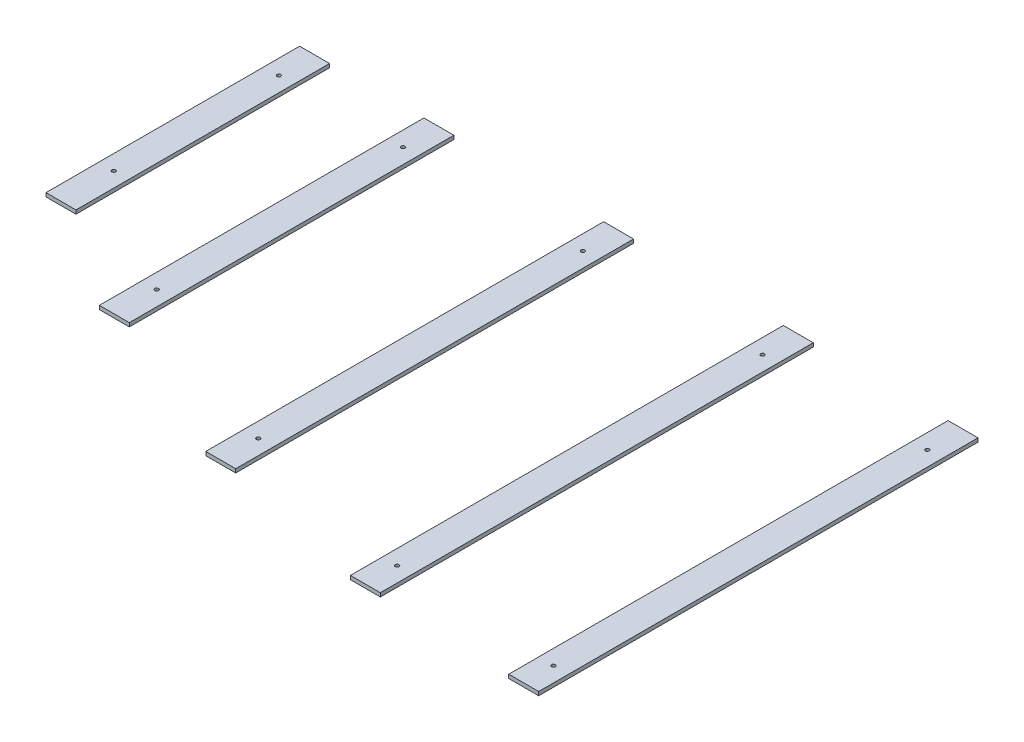
ISO-10303-21;
HEADER;
FILE_DESCRIPTION(('STEP AP214'),'2;1');
FILE_NAME('part.step','',(''),(''),'','','');
FILE_SCHEMA(('AUTOMOTIVE_DESIGN { 1 0 10303 214 1 1 1 1 }'));
ENDSEC;
DATA;
#1=APPLICATION_CONTEXT('core data for automotive mechanical design processes');
#2=APPLICATION_PROTOCOL_DEFINITION('international standard','automotive_design',2000,#1);
#3=PRODUCT_CONTEXT('',#1,'mechanical');
#4=PRODUCT('Part','Part','',(#3));
#5=PRODUCT_RELATED_PRODUCT_CATEGORY('part','',(#4));
#6=PRODUCT_DEFINITION_FORMATION('','',#4);
#7=PRODUCT_DEFINITION_CONTEXT('part definition',#1,'design');
#8=PRODUCT_DEFINITION('design','',#6,#7);
#9=PRODUCT_DEFINITION_SHAPE('','',#8);
#10=(LENGTH_UNIT() NAMED_UNIT(*) SI_UNIT(.MILLI.,.METRE.));
#11=(NAMED_UNIT(*) PLANE_ANGLE_UNIT() SI_UNIT($,.RADIAN.));
#12=(NAMED_UNIT(*) SI_UNIT($,.STERADIAN.) SOLID_ANGLE_UNIT());
#13=UNCERTAINTY_MEASURE_WITH_UNIT(LENGTH_MEASURE(1.E-05),#10,'distance_accuracy_value','');
#14=(GEOMETRIC_REPRESENTATION_CONTEXT(3) GLOBAL_UNCERTAINTY_ASSIGNED_CONTEXT((#13)) GLOBAL_UNIT_ASSIGNED_CONTEXT((#10,
#11,#12)) REPRESENTATION_CONTEXT('',''));
#15=CARTESIAN_POINT('',(0.,0.,0.));
#16=DIRECTION('',(0.,0.,1.));
#17=DIRECTION('',(1.,0.,0.));
#18=AXIS2_PLACEMENT_3D('',#15,#16,#17);
#19=CARTESIAN_POINT('',(0.,25.,0.));
#20=DIRECTION('',(0.,-1.,0.));
#21=DIRECTION('',(0.,0.,-1.));
#22=AXIS2_PLACEMENT_3D('',#19,#20,#21);
#23=PLANE('',#22);
#24=DIRECTION('',(0.,0.,-1.));
#25=VECTOR('',#24,1.);
#26=CARTESIAN_POINT('',(18902.9446458133,25.,9942.5828739722));
#27=LINE('',#26,#25);
#28=CARTESIAN_POINT('',(18902.9446458133,25.,11636.2194573529));
#29=VERTEX_POINT('',#28);
#30=CARTESIAN_POINT('',(18902.9446458133,25.,9942.5828739722));
#31=VERTEX_POINT('',#30);
#32=EDGE_CURVE('E101',#29,#31,#27,.T.);
#33=ORIENTED_EDGE('',*,*,#32,.T.);
#34=DIRECTION('',(-1.,0.,0.));
#35=VECTOR('',#34,1.);
#36=CARTESIAN_POINT('',(18902.9446458133,25.,9942.5828739722));
#37=LINE('',#36,#35);
#38=CARTESIAN_POINT('',(18702.9446458133,25.,9942.5828739722));
#39=VERTEX_POINT('',#38);
#40=EDGE_CURVE('E96',#31,#39,#37,.T.);
#41=ORIENTED_EDGE('',*,*,#40,.T.);
#42=DIRECTION('',(0.,0.,1.));
#43=VECTOR('',#42,1.);
#44=CARTESIAN_POINT('',(18702.9446458133,25.,9942.5828739722));
#45=LINE('',#44,#43);
#46=CARTESIAN_POINT('',(18702.9446458133,25.,11636.2194573529));
#47=VERTEX_POINT('',#46);
#48=EDGE_CURVE('E99',#39,#47,#45,.T.);
#49=ORIENTED_EDGE('',*,*,#48,.T.);
#50=DIRECTION('',(1.,0.,0.));
#51=VECTOR('',#50,1.);
#52=CARTESIAN_POINT('',(18902.9446458133,25.,11636.2194573529));
#53=LINE('',#52,#51);
#54=EDGE_CURVE('E66',#47,#29,#53,.T.);
#55=ORIENTED_EDGE('',*,*,#54,.T.);
#56=EDGE_LOOP('',(#33,#41,#49,#55));
#57=FACE_BOUND('',#56,.T.);
#58=CARTESIAN_POINT('',(18802.9446458133,25.,11283.6697787735));
#59=DIRECTION('',(0.,1.,0.));
#60=DIRECTION('',(0.,0.,1.));
#61=AXIS2_PLACEMENT_3D('',#58,#59,#60);
#62=CIRCLE('',#61,12.4999999999988);
#63=CARTESIAN_POINT('',(18802.9446458133,25.,11296.1697787735));
#64=VERTEX_POINT('',#63);
#65=EDGE_CURVE('E116',#64,#64,#62,.T.);
#66=ORIENTED_EDGE('',*,*,#65,.F.);
#67=EDGE_LOOP('',(#66));
#68=FACE_BOUND('',#67,.T.);
#69=CARTESIAN_POINT('',(18802.9446458133,25.,10181.0304593336));
#70=DIRECTION('',(0.,1.,0.));
#71=DIRECTION('',(0.,0.,1.));
#72=AXIS2_PLACEMENT_3D('',#69,#70,#71);
#73=CIRCLE('',#72,12.4999999999988);
#74=CARTESIAN_POINT('',(18802.9446458133,25.,10193.5304593336));
#75=VERTEX_POINT('',#74);
#76=EDGE_CURVE('E131',#75,#75,#73,.T.);
#77=ORIENTED_EDGE('',*,*,#76,.F.);
#78=EDGE_LOOP('',(#77));
#79=FACE_BOUND('',#78,.T.);
#80=ADVANCED_FACE('F49',(#57,#68,#79),#23,.F.);
#81=CARTESIAN_POINT('',(0.,0.,0.));
#82=DIRECTION('',(0.,-1.,0.));
#83=DIRECTION('',(0.,0.,-1.));
#84=AXIS2_PLACEMENT_3D('',#81,#82,#83);
#85=PLANE('',#84);
#86=CARTESIAN_POINT('',(18802.9446458133,0.,11283.6697787735));
#87=DIRECTION('',(0.,1.,0.));
#88=DIRECTION('',(0.,0.,1.));
#89=AXIS2_PLACEMENT_3D('',#86,#87,#88);
#90=CIRCLE('',#89,12.4999999999988);
#91=CARTESIAN_POINT('',(18802.9446458133,0.,11296.1697787735));
#92=VERTEX_POINT('',#91);
#93=EDGE_CURVE('E128',#92,#92,#90,.T.);
#94=ORIENTED_EDGE('',*,*,#93,.T.);
#95=EDGE_LOOP('',(#94));
#96=FACE_BOUND('',#95,.T.);
#97=DIRECTION('',(0.,0.,-1.));
#98=VECTOR('',#97,1.);
#99=CARTESIAN_POINT('',(18902.9446458133,0.,9942.5828739722));
#100=LINE('',#99,#98);
#101=CARTESIAN_POINT('',(18902.9446458133,0.,11636.2194573529));
#102=VERTEX_POINT('',#101);
#103=CARTESIAN_POINT('',(18902.9446458133,0.,9942.5828739722));
#104=VERTEX_POINT('',#103);
#105=EDGE_CURVE('E113',#102,#104,#100,.T.);
#106=ORIENTED_EDGE('',*,*,#105,.F.);
#107=DIRECTION('',(1.,0.,0.));
#108=VECTOR('',#107,1.);
#109=CARTESIAN_POINT('',(18902.9446458133,0.,11636.2194573529));
#110=LINE('',#109,#108);
#111=CARTESIAN_POINT('',(18702.9446458133,0.,11636.2194573529));
#112=VERTEX_POINT('',#111);
#113=EDGE_CURVE('E89',#112,#102,#110,.T.);
#114=ORIENTED_EDGE('',*,*,#113,.F.);
#115=DIRECTION('',(0.,0.,1.));
#116=VECTOR('',#115,1.);
#117=CARTESIAN_POINT('',(18702.9446458133,0.,9942.5828739722));
#118=LINE('',#117,#116);
#119=CARTESIAN_POINT('',(18702.9446458133,0.,9942.5828739722));
#120=VERTEX_POINT('',#119);
#121=EDGE_CURVE('E83',#120,#112,#118,.T.);
#122=ORIENTED_EDGE('',*,*,#121,.F.);
#123=DIRECTION('',(-1.,0.,0.));
#124=VECTOR('',#123,1.);
#125=CARTESIAN_POINT('',(18902.9446458133,0.,9942.5828739722));
#126=LINE('',#125,#124);
#127=EDGE_CURVE('E105',#104,#120,#126,.T.);
#128=ORIENTED_EDGE('',*,*,#127,.F.);
#129=EDGE_LOOP('',(#106,#114,#122,#128));
#130=FACE_BOUND('',#129,.T.);
#131=CARTESIAN_POINT('',(18802.9446458133,0.,10181.0304593336));
#132=DIRECTION('',(0.,1.,0.));
#133=DIRECTION('',(0.,0.,1.));
#134=AXIS2_PLACEMENT_3D('',#131,#132,#133);
#135=CIRCLE('',#134,12.4999999999988);
#136=CARTESIAN_POINT('',(18802.9446458133,0.,10193.5304593336));
#137=VERTEX_POINT('',#136);
#138=EDGE_CURVE('E134',#137,#137,#135,.T.);
#139=ORIENTED_EDGE('',*,*,#138,.T.);
#140=EDGE_LOOP('',(#139));
#141=FACE_BOUND('',#140,.T.);
#142=ADVANCED_FACE('F124',(#96,#130,#141),#85,.T.);
#143=CARTESIAN_POINT('',(18902.9446458133,25.,9942.5828739722));
#144=DIRECTION('',(-1.,0.,0.));
#145=DIRECTION('',(0.,0.,1.));
#146=AXIS2_PLACEMENT_3D('',#143,#144,#145);
#147=PLANE('',#146);
#148=ORIENTED_EDGE('',*,*,#105,.T.);
#149=DIRECTION('',(0.,-1.,0.));
#150=VECTOR('',#149,1.);
#151=CARTESIAN_POINT('',(18902.9446458133,25.,9942.5828739722));
#152=LINE('',#151,#150);
#153=EDGE_CURVE('E12',#31,#104,#152,.T.);
#154=ORIENTED_EDGE('',*,*,#153,.F.);
#155=ORIENTED_EDGE('',*,*,#32,.F.);
#156=DIRECTION('',(0.,-1.,0.));
#157=VECTOR('',#156,1.);
#158=CARTESIAN_POINT('',(18902.9446458133,25.,11636.2194573529));
#159=LINE('',#158,#157);
#160=EDGE_CURVE('E109',#29,#102,#159,.T.);
#161=ORIENTED_EDGE('',*,*,#160,.T.);
#162=EDGE_LOOP('',(#148,#154,#155,#161));
#163=FACE_BOUND('',#162,.T.);
#164=ADVANCED_FACE('F51',(#163),#147,.F.);
#165=CARTESIAN_POINT('',(18902.9446458133,25.,9942.5828739722));
#166=DIRECTION('',(0.,0.,1.));
#167=DIRECTION('',(1.,0.,0.));
#168=AXIS2_PLACEMENT_3D('',#165,#166,#167);
#169=PLANE('',#168);
#170=ORIENTED_EDGE('',*,*,#127,.T.);
#171=DIRECTION('',(0.,-1.,0.));
#172=VECTOR('',#171,1.);
#173=CARTESIAN_POINT('',(18702.9446458133,25.,9942.5828739722));
#174=LINE('',#173,#172);
#175=EDGE_CURVE('E58',#39,#120,#174,.T.);
#176=ORIENTED_EDGE('',*,*,#175,.F.);
#177=ORIENTED_EDGE('',*,*,#40,.F.);
#178=ORIENTED_EDGE('',*,*,#153,.T.);
#179=EDGE_LOOP('',(#170,#176,#177,#178));
#180=FACE_BOUND('',#179,.T.);
#181=ADVANCED_FACE('F104',(#180),#169,.F.);
#182=CARTESIAN_POINT('',(18702.9446458133,25.,9942.5828739722));
#183=DIRECTION('',(1.,0.,0.));
#184=DIRECTION('',(0.,0.,-1.));
#185=AXIS2_PLACEMENT_3D('',#182,#183,#184);
#186=PLANE('',#185);
#187=ORIENTED_EDGE('',*,*,#121,.T.);
#188=DIRECTION('',(0.,-1.,0.));
#189=VECTOR('',#188,1.);
#190=CARTESIAN_POINT('',(18702.9446458133,25.,11636.2194573529));
#191=LINE('',#190,#189);
#192=EDGE_CURVE('E106',#47,#112,#191,.T.);
#193=ORIENTED_EDGE('',*,*,#192,.F.);
#194=ORIENTED_EDGE('',*,*,#48,.F.);
#195=ORIENTED_EDGE('',*,*,#175,.T.);
#196=EDGE_LOOP('',(#187,#193,#194,#195));
#197=FACE_BOUND('',#196,.T.);
#198=ADVANCED_FACE('F107',(#197),#186,.F.);
#199=CARTESIAN_POINT('',(18902.9446458133,25.,11636.2194573529));
#200=DIRECTION('',(0.,0.,-1.));
#201=DIRECTION('',(-1.,0.,0.));
#202=AXIS2_PLACEMENT_3D('',#199,#200,#201);
#203=PLANE('',#202);
#204=ORIENTED_EDGE('',*,*,#113,.T.);
#205=ORIENTED_EDGE('',*,*,#160,.F.);
#206=ORIENTED_EDGE('',*,*,#54,.F.);
#207=ORIENTED_EDGE('',*,*,#192,.T.);
#208=EDGE_LOOP('',(#204,#205,#206,#207));
#209=FACE_BOUND('',#208,.T.);
#210=ADVANCED_FACE('F121',(#209),#203,.F.);
#211=CARTESIAN_POINT('',(18802.9446458133,25.,11283.6697787735));
#212=DIRECTION('',(0.,-1.,0.));
#213=DIRECTION('',(0.,0.,-1.));
#214=AXIS2_PLACEMENT_3D('',#211,#212,#213);
#215=CYLINDRICAL_SURFACE('',#214,12.4999999999988);
#216=ORIENTED_EDGE('',*,*,#65,.T.);
#217=EDGE_LOOP('',(#216));
#218=FACE_BOUND('',#217,.T.);
#219=ORIENTED_EDGE('',*,*,#93,.F.);
#220=EDGE_LOOP('',(#219));
#221=FACE_BOUND('',#220,.T.);
#222=ADVANCED_FACE('F151',(#218,#221),#215,.F.);
#223=CARTESIAN_POINT('',(18802.9446458133,25.,10181.0304593336));
#224=DIRECTION('',(0.,-1.,0.));
#225=DIRECTION('',(0.,0.,-1.));
#226=AXIS2_PLACEMENT_3D('',#223,#224,#225);
#227=CYLINDRICAL_SURFACE('',#226,12.4999999999988);
#228=ORIENTED_EDGE('',*,*,#76,.T.);
#229=EDGE_LOOP('',(#228));
#230=FACE_BOUND('',#229,.T.);
#231=ORIENTED_EDGE('',*,*,#138,.F.);
#232=EDGE_LOOP('',(#231));
#233=FACE_BOUND('',#232,.T.);
#234=ADVANCED_FACE('F140',(#230,#233),#227,.F.);
#235=CLOSED_SHELL('',(#80,#142,#164,#181,#198,#210,#222,#234));
#236=MANIFOLD_SOLID_BREP('B2',#235);
#237=CARTESIAN_POINT('',(0.,25.,0.));
#238=DIRECTION('',(0.,-1.,0.));
#239=DIRECTION('',(0.,0.,-1.));
#240=AXIS2_PLACEMENT_3D('',#237,#238,#239);
#241=PLANE('',#240);
#242=DIRECTION('',(0.,0.,-1.));
#243=VECTOR('',#242,1.);
#244=CARTESIAN_POINT('',(19732.9446458133,25.,9942.5828739722));
#245=LINE('',#244,#243);
#246=CARTESIAN_POINT('',(19732.9446458133,25.,12109.8435727021));
#247=VERTEX_POINT('',#246);
#248=CARTESIAN_POINT('',(19732.9446458133,25.,9942.5828739722));
#249=VERTEX_POINT('',#248);
#250=EDGE_CURVE('E276',#247,#249,#245,.T.);
#251=ORIENTED_EDGE('',*,*,#250,.T.);
#252=DIRECTION('',(-1.,0.,0.));
#253=VECTOR('',#252,1.);
#254=CARTESIAN_POINT('',(19732.9446458133,25.,9942.5828739722));
#255=LINE('',#254,#253);
#256=CARTESIAN_POINT('',(19532.9446458133,25.,9942.5828739722));
#257=VERTEX_POINT('',#256);
#258=EDGE_CURVE('E271',#249,#257,#255,.T.);
#259=ORIENTED_EDGE('',*,*,#258,.T.);
#260=DIRECTION('',(0.,0.,1.));
#261=VECTOR('',#260,1.);
#262=CARTESIAN_POINT('',(19532.9446458133,25.,9942.5828739722));
#263=LINE('',#262,#261);
#264=CARTESIAN_POINT('',(19532.9446458133,25.,12109.8435727021));
#265=VERTEX_POINT('',#264);
#266=EDGE_CURVE('E274',#257,#265,#263,.T.);
#267=ORIENTED_EDGE('',*,*,#266,.T.);
#268=DIRECTION('',(1.,0.,0.));
#269=VECTOR('',#268,1.);
#270=CARTESIAN_POINT('',(19732.9446458133,25.,12109.8435727021));
#271=LINE('',#270,#269);
#272=EDGE_CURVE('E241',#265,#247,#271,.T.);
#273=ORIENTED_EDGE('',*,*,#272,.T.);
#274=EDGE_LOOP('',(#251,#259,#267,#273));
#275=FACE_BOUND('',#274,.T.);
#276=CARTESIAN_POINT('',(19632.9446458133,25.,11826.9154481533));
#277=DIRECTION('',(0.,1.,0.));
#278=DIRECTION('',(0.,0.,1.));
#279=AXIS2_PLACEMENT_3D('',#276,#277,#278);
#280=CIRCLE('',#279,12.4999999999988);
#281=CARTESIAN_POINT('',(19632.9446458133,25.,11839.4154481533));
#282=VERTEX_POINT('',#281);
#283=EDGE_CURVE('E291',#282,#282,#280,.T.);
#284=ORIENTED_EDGE('',*,*,#283,.F.);
#285=EDGE_LOOP('',(#284));
#286=FACE_BOUND('',#285,.T.);
#287=CARTESIAN_POINT('',(19632.9446458133,25.,10181.0304593336));
#288=DIRECTION('',(0.,1.,0.));
#289=DIRECTION('',(0.,0.,1.));
#290=AXIS2_PLACEMENT_3D('',#287,#288,#289);
#291=CIRCLE('',#290,12.4999999999988);
#292=CARTESIAN_POINT('',(19632.9446458133,25.,10193.5304593336));
#293=VERTEX_POINT('',#292);
#294=EDGE_CURVE('E306',#293,#293,#291,.T.);
#295=ORIENTED_EDGE('',*,*,#294,.F.);
#296=EDGE_LOOP('',(#295));
#297=FACE_BOUND('',#296,.T.);
#298=ADVANCED_FACE('F224',(#275,#286,#297),#241,.F.);
#299=CARTESIAN_POINT('',(0.,0.,0.));
#300=DIRECTION('',(0.,-1.,0.));
#301=DIRECTION('',(0.,0.,-1.));
#302=AXIS2_PLACEMENT_3D('',#299,#300,#301);
#303=PLANE('',#302);
#304=CARTESIAN_POINT('',(19632.9446458133,0.,11826.9154481533));
#305=DIRECTION('',(0.,1.,0.));
#306=DIRECTION('',(0.,0.,1.));
#307=AXIS2_PLACEMENT_3D('',#304,#305,#306);
#308=CIRCLE('',#307,12.4999999999988);
#309=CARTESIAN_POINT('',(19632.9446458133,0.,11839.4154481533));
#310=VERTEX_POINT('',#309);
#311=EDGE_CURVE('E303',#310,#310,#308,.T.);
#312=ORIENTED_EDGE('',*,*,#311,.T.);
#313=EDGE_LOOP('',(#312));
#314=FACE_BOUND('',#313,.T.);
#315=DIRECTION('',(0.,0.,-1.));
#316=VECTOR('',#315,1.);
#317=CARTESIAN_POINT('',(19732.9446458133,0.,9942.5828739722));
#318=LINE('',#317,#316);
#319=CARTESIAN_POINT('',(19732.9446458133,0.,12109.8435727021));
#320=VERTEX_POINT('',#319);
#321=CARTESIAN_POINT('',(19732.9446458133,0.,9942.5828739722));
#322=VERTEX_POINT('',#321);
#323=EDGE_CURVE('E288',#320,#322,#318,.T.);
#324=ORIENTED_EDGE('',*,*,#323,.F.);
#325=DIRECTION('',(1.,0.,0.));
#326=VECTOR('',#325,1.);
#327=CARTESIAN_POINT('',(19732.9446458133,0.,12109.8435727021));
#328=LINE('',#327,#326);
#329=CARTESIAN_POINT('',(19532.9446458133,0.,12109.8435727021));
#330=VERTEX_POINT('',#329);
#331=EDGE_CURVE('E264',#330,#320,#328,.T.);
#332=ORIENTED_EDGE('',*,*,#331,.F.);
#333=DIRECTION('',(0.,0.,1.));
#334=VECTOR('',#333,1.);
#335=CARTESIAN_POINT('',(19532.9446458133,0.,9942.5828739722));
#336=LINE('',#335,#334);
#337=CARTESIAN_POINT('',(19532.9446458133,0.,9942.5828739722));
#338=VERTEX_POINT('',#337);
#339=EDGE_CURVE('E258',#338,#330,#336,.T.);
#340=ORIENTED_EDGE('',*,*,#339,.F.);
#341=DIRECTION('',(-1.,0.,0.));
#342=VECTOR('',#341,1.);
#343=CARTESIAN_POINT('',(19732.9446458133,0.,9942.5828739722));
#344=LINE('',#343,#342);
#345=EDGE_CURVE('E280',#322,#338,#344,.T.);
#346=ORIENTED_EDGE('',*,*,#345,.F.);
#347=EDGE_LOOP('',(#324,#332,#340,#346));
#348=FACE_BOUND('',#347,.T.);
#349=CARTESIAN_POINT('',(19632.9446458133,0.,10181.0304593336));
#350=DIRECTION('',(0.,1.,0.));
#351=DIRECTION('',(0.,0.,1.));
#352=AXIS2_PLACEMENT_3D('',#349,#350,#351);
#353=CIRCLE('',#352,12.4999999999988);
#354=CARTESIAN_POINT('',(19632.9446458133,0.,10193.5304593336));
#355=VERTEX_POINT('',#354);
#356=EDGE_CURVE('E309',#355,#355,#353,.T.);
#357=ORIENTED_EDGE('',*,*,#356,.T.);
#358=EDGE_LOOP('',(#357));
#359=FACE_BOUND('',#358,.T.);
#360=ADVANCED_FACE('F299',(#314,#348,#359),#303,.T.);
#361=CARTESIAN_POINT('',(19732.9446458133,25.,9942.5828739722));
#362=DIRECTION('',(-1.,0.,0.));
#363=DIRECTION('',(0.,0.,1.));
#364=AXIS2_PLACEMENT_3D('',#361,#362,#363);
#365=PLANE('',#364);
#366=ORIENTED_EDGE('',*,*,#323,.T.);
#367=DIRECTION('',(0.,-1.,0.));
#368=VECTOR('',#367,1.);
#369=CARTESIAN_POINT('',(19732.9446458133,25.,9942.5828739722));
#370=LINE('',#369,#368);
#371=EDGE_CURVE('E47',#249,#322,#370,.T.);
#372=ORIENTED_EDGE('',*,*,#371,.F.);
#373=ORIENTED_EDGE('',*,*,#250,.F.);
#374=DIRECTION('',(0.,-1.,0.));
#375=VECTOR('',#374,1.);
#376=CARTESIAN_POINT('',(19732.9446458133,25.,12109.8435727021));
#377=LINE('',#376,#375);
#378=EDGE_CURVE('E284',#247,#320,#377,.T.);
#379=ORIENTED_EDGE('',*,*,#378,.T.);
#380=EDGE_LOOP('',(#366,#372,#373,#379));
#381=FACE_BOUND('',#380,.T.);
#382=ADVANCED_FACE('F226',(#381),#365,.F.);
#383=CARTESIAN_POINT('',(19732.9446458133,25.,9942.5828739722));
#384=DIRECTION('',(0.,0.,1.));
#385=DIRECTION('',(1.,0.,0.));
#386=AXIS2_PLACEMENT_3D('',#383,#384,#385);
#387=PLANE('',#386);
#388=ORIENTED_EDGE('',*,*,#345,.T.);
#389=DIRECTION('',(0.,-1.,0.));
#390=VECTOR('',#389,1.);
#391=CARTESIAN_POINT('',(19532.9446458133,25.,9942.5828739722));
#392=LINE('',#391,#390);
#393=EDGE_CURVE('E233',#257,#338,#392,.T.);
#394=ORIENTED_EDGE('',*,*,#393,.F.);
#395=ORIENTED_EDGE('',*,*,#258,.F.);
#396=ORIENTED_EDGE('',*,*,#371,.T.);
#397=EDGE_LOOP('',(#388,#394,#395,#396));
#398=FACE_BOUND('',#397,.T.);
#399=ADVANCED_FACE('F279',(#398),#387,.F.);
#400=CARTESIAN_POINT('',(19532.9446458133,25.,9942.5828739722));
#401=DIRECTION('',(1.,0.,0.));
#402=DIRECTION('',(0.,0.,-1.));
#403=AXIS2_PLACEMENT_3D('',#400,#401,#402);
#404=PLANE('',#403);
#405=ORIENTED_EDGE('',*,*,#339,.T.);
#406=DIRECTION('',(0.,-1.,0.));
#407=VECTOR('',#406,1.);
#408=CARTESIAN_POINT('',(19532.9446458133,25.,12109.8435727021));
#409=LINE('',#408,#407);
#410=EDGE_CURVE('E281',#265,#330,#409,.T.);
#411=ORIENTED_EDGE('',*,*,#410,.F.);
#412=ORIENTED_EDGE('',*,*,#266,.F.);
#413=ORIENTED_EDGE('',*,*,#393,.T.);
#414=EDGE_LOOP('',(#405,#411,#412,#413));
#415=FACE_BOUND('',#414,.T.);
#416=ADVANCED_FACE('F282',(#415),#404,.F.);
#417=CARTESIAN_POINT('',(19732.9446458133,25.,12109.8435727021));
#418=DIRECTION('',(0.,0.,-1.));
#419=DIRECTION('',(-1.,0.,0.));
#420=AXIS2_PLACEMENT_3D('',#417,#418,#419);
#421=PLANE('',#420);
#422=ORIENTED_EDGE('',*,*,#331,.T.);
#423=ORIENTED_EDGE('',*,*,#378,.F.);
#424=ORIENTED_EDGE('',*,*,#272,.F.);
#425=ORIENTED_EDGE('',*,*,#410,.T.);
#426=EDGE_LOOP('',(#422,#423,#424,#425));
#427=FACE_BOUND('',#426,.T.);
#428=ADVANCED_FACE('F296',(#427),#421,.F.);
#429=CARTESIAN_POINT('',(19632.9446458133,25.,11826.9154481533));
#430=DIRECTION('',(0.,-1.,0.));
#431=DIRECTION('',(0.,0.,-1.));
#432=AXIS2_PLACEMENT_3D('',#429,#430,#431);
#433=CYLINDRICAL_SURFACE('',#432,12.4999999999988);
#434=ORIENTED_EDGE('',*,*,#283,.T.);
#435=EDGE_LOOP('',(#434));
#436=FACE_BOUND('',#435,.T.);
#437=ORIENTED_EDGE('',*,*,#311,.F.);
#438=EDGE_LOOP('',(#437));
#439=FACE_BOUND('',#438,.T.);
#440=ADVANCED_FACE('F326',(#436,#439),#433,.F.);
#441=CARTESIAN_POINT('',(19632.9446458133,25.,10181.0304593336));
#442=DIRECTION('',(0.,-1.,0.));
#443=DIRECTION('',(0.,0.,-1.));
#444=AXIS2_PLACEMENT_3D('',#441,#442,#443);
#445=CYLINDRICAL_SURFACE('',#444,12.4999999999988);
#446=ORIENTED_EDGE('',*,*,#294,.T.);
#447=EDGE_LOOP('',(#446));
#448=FACE_BOUND('',#447,.T.);
#449=ORIENTED_EDGE('',*,*,#356,.F.);
#450=EDGE_LOOP('',(#449));
#451=FACE_BOUND('',#450,.T.);
#452=ADVANCED_FACE('F315',(#448,#451),#445,.F.);
#453=CLOSED_SHELL('',(#298,#360,#382,#399,#416,#428,#440,#452));
#454=MANIFOLD_SOLID_BREP('B6',#453);
#455=CARTESIAN_POINT('',(0.,25.,0.));
#456=DIRECTION('',(0.,-1.,0.));
#457=DIRECTION('',(0.,0.,-1.));
#458=AXIS2_PLACEMENT_3D('',#455,#456,#457);
#459=PLANE('',#458);
#460=DIRECTION('',(0.,0.,-1.));
#461=VECTOR('',#460,1.);
#462=CARTESIAN_POINT('',(20932.9446458133,25.,9942.5828739722));
#463=LINE('',#462,#461);
#464=CARTESIAN_POINT('',(20932.9446458133,25.,12599.4325458721));
#465=VERTEX_POINT('',#464);
#466=CARTESIAN_POINT('',(20932.9446458133,25.,9942.5828739722));
#467=VERTEX_POINT('',#466);
#468=EDGE_CURVE('E451',#465,#467,#463,.T.);
#469=ORIENTED_EDGE('',*,*,#468,.T.);
#470=DIRECTION('',(-1.,0.,0.));
#471=VECTOR('',#470,1.);
#472=CARTESIAN_POINT('',(20932.9446458133,25.,9942.5828739722));
#473=LINE('',#472,#471);
#474=CARTESIAN_POINT('',(20732.9446458133,25.,9942.5828739722));
#475=VERTEX_POINT('',#474);
#476=EDGE_CURVE('E446',#467,#475,#473,.T.);
#477=ORIENTED_EDGE('',*,*,#476,.T.);
#478=DIRECTION('',(0.,0.,1.));
#479=VECTOR('',#478,1.);
#480=CARTESIAN_POINT('',(20732.9446458133,25.,9942.5828739722));
#481=LINE('',#480,#479);
#482=CARTESIAN_POINT('',(20732.9446458133,25.,12599.4325458721));
#483=VERTEX_POINT('',#482);
#484=EDGE_CURVE('E449',#475,#483,#481,.T.);
#485=ORIENTED_EDGE('',*,*,#484,.T.);
#486=DIRECTION('',(1.,0.,0.));
#487=VECTOR('',#486,1.);
#488=CARTESIAN_POINT('',(20932.9446458133,25.,12599.4325458721));
#489=LINE('',#488,#487);
#490=EDGE_CURVE('E416',#483,#465,#489,.T.);
#491=ORIENTED_EDGE('',*,*,#490,.T.);
#492=EDGE_LOOP('',(#469,#477,#485,#491));
#493=FACE_BOUND('',#492,.T.);
#494=CARTESIAN_POINT('',(20832.9446458133,25.,12348.754240871));
#495=DIRECTION('',(0.,1.,0.));
#496=DIRECTION('',(0.,0.,1.));
#497=AXIS2_PLACEMENT_3D('',#494,#495,#496);
#498=CIRCLE('',#497,12.4999999999988);
#499=CARTESIAN_POINT('',(20832.9446458133,25.,12361.254240871));
#500=VERTEX_POINT('',#499);
#501=EDGE_CURVE('E466',#500,#500,#498,.T.);
#502=ORIENTED_EDGE('',*,*,#501,.F.);
#503=EDGE_LOOP('',(#502));
#504=FACE_BOUND('',#503,.T.);
#505=CARTESIAN_POINT('',(20832.9446458133,25.,10181.0304593336));
#506=DIRECTION('',(0.,1.,0.));
#507=DIRECTION('',(0.,0.,1.));
#508=AXIS2_PLACEMENT_3D('',#505,#506,#507);
#509=CIRCLE('',#508,12.4999999999988);
#510=CARTESIAN_POINT('',(20832.9446458133,25.,10193.5304593336));
#511=VERTEX_POINT('',#510);
#512=EDGE_CURVE('E481',#511,#511,#509,.T.);
#513=ORIENTED_EDGE('',*,*,#512,.F.);
#514=EDGE_LOOP('',(#513));
#515=FACE_BOUND('',#514,.T.);
#516=ADVANCED_FACE('F399',(#493,#504,#515),#459,.F.);
#517=CARTESIAN_POINT('',(0.,0.,0.));
#518=DIRECTION('',(0.,-1.,0.));
#519=DIRECTION('',(0.,0.,-1.));
#520=AXIS2_PLACEMENT_3D('',#517,#518,#519);
#521=PLANE('',#520);
#522=CARTESIAN_POINT('',(20832.9446458133,0.,12348.754240871));
#523=DIRECTION('',(0.,1.,0.));
#524=DIRECTION('',(0.,0.,1.));
#525=AXIS2_PLACEMENT_3D('',#522,#523,#524);
#526=CIRCLE('',#525,12.4999999999988);
#527=CARTESIAN_POINT('',(20832.9446458133,0.,12361.254240871));
#528=VERTEX_POINT('',#527);
#529=EDGE_CURVE('E478',#528,#528,#526,.T.);
#530=ORIENTED_EDGE('',*,*,#529,.T.);
#531=EDGE_LOOP('',(#530));
#532=FACE_BOUND('',#531,.T.);
#533=DIRECTION('',(0.,0.,-1.));
#534=VECTOR('',#533,1.);
#535=CARTESIAN_POINT('',(20932.9446458133,0.,9942.5828739722));
#536=LINE('',#535,#534);
#537=CARTESIAN_POINT('',(20932.9446458133,0.,12599.4325458721));
#538=VERTEX_POINT('',#537);
#539=CARTESIAN_POINT('',(20932.9446458133,0.,9942.5828739722));
#540=VERTEX_POINT('',#539);
#541=EDGE_CURVE('E463',#538,#540,#536,.T.);
#542=ORIENTED_EDGE('',*,*,#541,.F.);
#543=DIRECTION('',(1.,0.,0.));
#544=VECTOR('',#543,1.);
#545=CARTESIAN_POINT('',(20932.9446458133,0.,12599.4325458721));
#546=LINE('',#545,#544);
#547=CARTESIAN_POINT('',(20732.9446458133,0.,12599.4325458721));
#548=VERTEX_POINT('',#547);
#549=EDGE_CURVE('E439',#548,#538,#546,.T.);
#550=ORIENTED_EDGE('',*,*,#549,.F.);
#551=DIRECTION('',(0.,0.,1.));
#552=VECTOR('',#551,1.);
#553=CARTESIAN_POINT('',(20732.9446458133,0.,9942.5828739722));
#554=LINE('',#553,#552);
#555=CARTESIAN_POINT('',(20732.9446458133,0.,9942.5828739722));
#556=VERTEX_POINT('',#555);
#557=EDGE_CURVE('E433',#556,#548,#554,.T.);
#558=ORIENTED_EDGE('',*,*,#557,.F.);
#559=DIRECTION('',(-1.,0.,0.));
#560=VECTOR('',#559,1.);
#561=CARTESIAN_POINT('',(20932.9446458133,0.,9942.5828739722));
#562=LINE('',#561,#560);
#563=EDGE_CURVE('E455',#540,#556,#562,.T.);
#564=ORIENTED_EDGE('',*,*,#563,.F.);
#565=EDGE_LOOP('',(#542,#550,#558,#564));
#566=FACE_BOUND('',#565,.T.);
#567=CARTESIAN_POINT('',(20832.9446458133,0.,10181.0304593336));
#568=DIRECTION('',(0.,1.,0.));
#569=DIRECTION('',(0.,0.,1.));
#570=AXIS2_PLACEMENT_3D('',#567,#568,#569);
#571=CIRCLE('',#570,12.4999999999988);
#572=CARTESIAN_POINT('',(20832.9446458133,0.,10193.5304593336));
#573=VERTEX_POINT('',#572);
#574=EDGE_CURVE('E484',#573,#573,#571,.T.);
#575=ORIENTED_EDGE('',*,*,#574,.T.);
#576=EDGE_LOOP('',(#575));
#577=FACE_BOUND('',#576,.T.);
#578=ADVANCED_FACE('F474',(#532,#566,#577),#521,.T.);
#579=CARTESIAN_POINT('',(20932.9446458133,25.,9942.5828739722));
#580=DIRECTION('',(-1.,0.,0.));
#581=DIRECTION('',(0.,0.,1.));
#582=AXIS2_PLACEMENT_3D('',#579,#580,#581);
#583=PLANE('',#582);
#584=ORIENTED_EDGE('',*,*,#541,.T.);
#585=DIRECTION('',(0.,-1.,0.));
#586=VECTOR('',#585,1.);
#587=CARTESIAN_POINT('',(20932.9446458133,25.,9942.5828739722));
#588=LINE('',#587,#586);
#589=EDGE_CURVE('E222',#467,#540,#588,.T.);
#590=ORIENTED_EDGE('',*,*,#589,.F.);
#591=ORIENTED_EDGE('',*,*,#468,.F.);
#592=DIRECTION('',(0.,-1.,0.));
#593=VECTOR('',#592,1.);
#594=CARTESIAN_POINT('',(20932.9446458133,25.,12599.4325458721));
#595=LINE('',#594,#593);
#596=EDGE_CURVE('E459',#465,#538,#595,.T.);
#597=ORIENTED_EDGE('',*,*,#596,.T.);
#598=EDGE_LOOP('',(#584,#590,#591,#597));
#599=FACE_BOUND('',#598,.T.);
#600=ADVANCED_FACE('F401',(#599),#583,.F.);
#601=CARTESIAN_POINT('',(20932.9446458133,25.,9942.5828739722));
#602=DIRECTION('',(0.,0.,1.));
#603=DIRECTION('',(1.,0.,0.));
#604=AXIS2_PLACEMENT_3D('',#601,#602,#603);
#605=PLANE('',#604);
#606=ORIENTED_EDGE('',*,*,#563,.T.);
#607=DIRECTION('',(0.,-1.,0.));
#608=VECTOR('',#607,1.);
#609=CARTESIAN_POINT('',(20732.9446458133,25.,9942.5828739722));
#610=LINE('',#609,#608);
#611=EDGE_CURVE('E408',#475,#556,#610,.T.);
#612=ORIENTED_EDGE('',*,*,#611,.F.);
#613=ORIENTED_EDGE('',*,*,#476,.F.);
#614=ORIENTED_EDGE('',*,*,#589,.T.);
#615=EDGE_LOOP('',(#606,#612,#613,#614));
#616=FACE_BOUND('',#615,.T.);
#617=ADVANCED_FACE('F454',(#616),#605,.F.);
#618=CARTESIAN_POINT('',(20732.9446458133,25.,9942.5828739722));
#619=DIRECTION('',(1.,0.,0.));
#620=DIRECTION('',(0.,0.,-1.));
#621=AXIS2_PLACEMENT_3D('',#618,#619,#620);
#622=PLANE('',#621);
#623=ORIENTED_EDGE('',*,*,#557,.T.);
#624=DIRECTION('',(0.,-1.,0.));
#625=VECTOR('',#624,1.);
#626=CARTESIAN_POINT('',(20732.9446458133,25.,12599.4325458721));
#627=LINE('',#626,#625);
#628=EDGE_CURVE('E456',#483,#548,#627,.T.);
#629=ORIENTED_EDGE('',*,*,#628,.F.);
#630=ORIENTED_EDGE('',*,*,#484,.F.);
#631=ORIENTED_EDGE('',*,*,#611,.T.);
#632=EDGE_LOOP('',(#623,#629,#630,#631));
#633=FACE_BOUND('',#632,.T.);
#634=ADVANCED_FACE('F457',(#633),#622,.F.);
#635=CARTESIAN_POINT('',(20932.9446458133,25.,12599.4325458721));
#636=DIRECTION('',(0.,0.,-1.));
#637=DIRECTION('',(-1.,0.,0.));
#638=AXIS2_PLACEMENT_3D('',#635,#636,#637);
#639=PLANE('',#638);
#640=ORIENTED_EDGE('',*,*,#549,.T.);
#641=ORIENTED_EDGE('',*,*,#596,.F.);
#642=ORIENTED_EDGE('',*,*,#490,.F.);
#643=ORIENTED_EDGE('',*,*,#628,.T.);
#644=EDGE_LOOP('',(#640,#641,#642,#643));
#645=FACE_BOUND('',#644,.T.);
#646=ADVANCED_FACE('F471',(#645),#639,.F.);
#647=CARTESIAN_POINT('',(20832.9446458133,25.,12348.754240871));
#648=DIRECTION('',(0.,-1.,0.));
#649=DIRECTION('',(0.,0.,-1.));
#650=AXIS2_PLACEMENT_3D('',#647,#648,#649);
#651=CYLINDRICAL_SURFACE('',#650,12.4999999999988);
#652=ORIENTED_EDGE('',*,*,#501,.T.);
#653=EDGE_LOOP('',(#652));
#654=FACE_BOUND('',#653,.T.);
#655=ORIENTED_EDGE('',*,*,#529,.F.);
#656=EDGE_LOOP('',(#655));
#657=FACE_BOUND('',#656,.T.);
#658=ADVANCED_FACE('F501',(#654,#657),#651,.F.);
#659=CARTESIAN_POINT('',(20832.9446458133,25.,10181.0304593336));
#660=DIRECTION('',(0.,-1.,0.));
#661=DIRECTION('',(0.,0.,-1.));
#662=AXIS2_PLACEMENT_3D('',#659,#660,#661);
#663=CYLINDRICAL_SURFACE('',#662,12.4999999999988);
#664=ORIENTED_EDGE('',*,*,#512,.T.);
#665=EDGE_LOOP('',(#664));
#666=FACE_BOUND('',#665,.T.);
#667=ORIENTED_EDGE('',*,*,#574,.F.);
#668=EDGE_LOOP('',(#667));
#669=FACE_BOUND('',#668,.T.);
#670=ADVANCED_FACE('F490',(#666,#669),#663,.F.);
#671=CLOSED_SHELL('',(#516,#578,#600,#617,#634,#646,#658,#670));
#672=MANIFOLD_SOLID_BREP('B41',#671);
#673=CARTESIAN_POINT('',(0.,25.,0.));
#674=DIRECTION('',(0.,-1.,0.));
#675=DIRECTION('',(0.,0.,-1.));
#676=AXIS2_PLACEMENT_3D('',#673,#674,#675);
#677=PLANE('',#676);
#678=DIRECTION('',(0.,0.,-1.));
#679=VECTOR('',#678,1.);
#680=CARTESIAN_POINT('',(22132.9446458133,25.,9942.5828739722));
#681=LINE('',#680,#679);
#682=CARTESIAN_POINT('',(22132.9446458133,25.,12833.58379391));
#683=VERTEX_POINT('',#682);
#684=CARTESIAN_POINT('',(22132.9446458133,25.,9942.5828739722));
#685=VERTEX_POINT('',#684);
#686=EDGE_CURVE('E625',#683,#685,#681,.T.);
#687=ORIENTED_EDGE('',*,*,#686,.T.);
#688=DIRECTION('',(-1.,0.,0.));
#689=VECTOR('',#688,1.);
#690=CARTESIAN_POINT('',(22132.9446458133,25.,9942.5828739722));
#691=LINE('',#690,#689);
#692=CARTESIAN_POINT('',(21932.9446458133,25.,9942.5828739722));
#693=VERTEX_POINT('',#692);
#694=EDGE_CURVE('E620',#685,#693,#691,.T.);
#695=ORIENTED_EDGE('',*,*,#694,.T.);
#696=DIRECTION('',(0.,0.,1.));
#697=VECTOR('',#696,1.);
#698=CARTESIAN_POINT('',(21932.9446458133,25.,9942.5828739722));
#699=LINE('',#698,#697);
#700=CARTESIAN_POINT('',(21932.9446458133,25.,12833.58379391));
#701=VERTEX_POINT('',#700);
#702=EDGE_CURVE('E623',#693,#701,#699,.T.);
#703=ORIENTED_EDGE('',*,*,#702,.T.);
#704=DIRECTION('',(1.,0.,0.));
#705=VECTOR('',#704,1.);
#706=CARTESIAN_POINT('',(22132.9446458133,25.,12833.58379391));
#707=LINE('',#706,#705);
#708=EDGE_CURVE('E590',#701,#683,#707,.T.);
#709=ORIENTED_EDGE('',*,*,#708,.T.);
#710=EDGE_LOOP('',(#687,#695,#703,#709));
#711=FACE_BOUND('',#710,.T.);
#712=CARTESIAN_POINT('',(22032.9446458133,25.,12621.2282851754));
#713=DIRECTION('',(0.,1.,0.));
#714=DIRECTION('',(0.,0.,1.));
#715=AXIS2_PLACEMENT_3D('',#712,#713,#714);
#716=CIRCLE('',#715,12.4999999999988);
#717=CARTESIAN_POINT('',(22032.9446458133,25.,12633.7282851754));
#718=VERTEX_POINT('',#717);
#719=EDGE_CURVE('E640',#718,#718,#716,.T.);
#720=ORIENTED_EDGE('',*,*,#719,.F.);
#721=EDGE_LOOP('',(#720));
#722=FACE_BOUND('',#721,.T.);
#723=CARTESIAN_POINT('',(22032.9446458133,25.,10181.0304593336));
#724=DIRECTION('',(0.,1.,0.));
#725=DIRECTION('',(0.,0.,1.));
#726=AXIS2_PLACEMENT_3D('',#723,#724,#725);
#727=CIRCLE('',#726,12.4999999999988);
#728=CARTESIAN_POINT('',(22032.9446458133,25.,10193.5304593336));
#729=VERTEX_POINT('',#728);
#730=EDGE_CURVE('E655',#729,#729,#727,.T.);
#731=ORIENTED_EDGE('',*,*,#730,.F.);
#732=EDGE_LOOP('',(#731));
#733=FACE_BOUND('',#732,.T.);
#734=ADVANCED_FACE('F573',(#711,#722,#733),#677,.F.);
#735=CARTESIAN_POINT('',(0.,0.,0.));
#736=DIRECTION('',(0.,-1.,0.));
#737=DIRECTION('',(0.,0.,-1.));
#738=AXIS2_PLACEMENT_3D('',#735,#736,#737);
#739=PLANE('',#738);
#740=CARTESIAN_POINT('',(22032.9446458133,0.,12621.2282851754));
#741=DIRECTION('',(0.,1.,0.));
#742=DIRECTION('',(0.,0.,1.));
#743=AXIS2_PLACEMENT_3D('',#740,#741,#742);
#744=CIRCLE('',#743,12.4999999999988);
#745=CARTESIAN_POINT('',(22032.9446458133,0.,12633.7282851754));
#746=VERTEX_POINT('',#745);
#747=EDGE_CURVE('E652',#746,#746,#744,.T.);
#748=ORIENTED_EDGE('',*,*,#747,.T.);
#749=EDGE_LOOP('',(#748));
#750=FACE_BOUND('',#749,.T.);
#751=DIRECTION('',(0.,0.,-1.));
#752=VECTOR('',#751,1.);
#753=CARTESIAN_POINT('',(22132.9446458133,0.,9942.5828739722));
#754=LINE('',#753,#752);
#755=CARTESIAN_POINT('',(22132.9446458133,0.,12833.58379391));
#756=VERTEX_POINT('',#755);
#757=CARTESIAN_POINT('',(22132.9446458133,0.,9942.5828739722));
#758=VERTEX_POINT('',#757);
#759=EDGE_CURVE('E637',#756,#758,#754,.T.);
#760=ORIENTED_EDGE('',*,*,#759,.F.);
#761=DIRECTION('',(1.,0.,0.));
#762=VECTOR('',#761,1.);
#763=CARTESIAN_POINT('',(22132.9446458133,0.,12833.58379391));
#764=LINE('',#763,#762);
#765=CARTESIAN_POINT('',(21932.9446458133,0.,12833.58379391));
#766=VERTEX_POINT('',#765);
#767=EDGE_CURVE('E613',#766,#756,#764,.T.);
#768=ORIENTED_EDGE('',*,*,#767,.F.);
#769=DIRECTION('',(0.,0.,1.));
#770=VECTOR('',#769,1.);
#771=CARTESIAN_POINT('',(21932.9446458133,0.,9942.5828739722));
#772=LINE('',#771,#770);
#773=CARTESIAN_POINT('',(21932.9446458133,0.,9942.5828739722));
#774=VERTEX_POINT('',#773);
#775=EDGE_CURVE('E607',#774,#766,#772,.T.);
#776=ORIENTED_EDGE('',*,*,#775,.F.);
#777=DIRECTION('',(-1.,0.,0.));
#778=VECTOR('',#777,1.);
#779=CARTESIAN_POINT('',(22132.9446458133,0.,9942.5828739722));
#780=LINE('',#779,#778);
#781=EDGE_CURVE('E629',#758,#774,#780,.T.);
#782=ORIENTED_EDGE('',*,*,#781,.F.);
#783=EDGE_LOOP('',(#760,#768,#776,#782));
#784=FACE_BOUND('',#783,.T.);
#785=CARTESIAN_POINT('',(22032.9446458133,0.,10181.0304593336));
#786=DIRECTION('',(0.,1.,0.));
#787=DIRECTION('',(0.,0.,1.));
#788=AXIS2_PLACEMENT_3D('',#785,#786,#787);
#789=CIRCLE('',#788,12.4999999999988);
#790=CARTESIAN_POINT('',(22032.9446458133,0.,10193.5304593336));
#791=VERTEX_POINT('',#790);
#792=EDGE_CURVE('E658',#791,#791,#789,.T.);
#793=ORIENTED_EDGE('',*,*,#792,.T.);
#794=EDGE_LOOP('',(#793));
#795=FACE_BOUND('',#794,.T.);
#796=ADVANCED_FACE('F648',(#750,#784,#795),#739,.T.);
#797=CARTESIAN_POINT('',(22132.9446458133,25.,9942.5828739722));
#798=DIRECTION('',(-1.,0.,0.));
#799=DIRECTION('',(0.,0.,1.));
#800=AXIS2_PLACEMENT_3D('',#797,#798,#799);
#801=PLANE('',#800);
#802=ORIENTED_EDGE('',*,*,#759,.T.);
#803=DIRECTION('',(0.,-1.,0.));
#804=VECTOR('',#803,1.);
#805=CARTESIAN_POINT('',(22132.9446458133,25.,9942.5828739722));
#806=LINE('',#805,#804);
#807=EDGE_CURVE('E397',#685,#758,#806,.T.);
#808=ORIENTED_EDGE('',*,*,#807,.F.);
#809=ORIENTED_EDGE('',*,*,#686,.F.);
#810=DIRECTION('',(0.,-1.,0.));
#811=VECTOR('',#810,1.);
#812=CARTESIAN_POINT('',(22132.9446458133,25.,12833.58379391));
#813=LINE('',#812,#811);
#814=EDGE_CURVE('E633',#683,#756,#813,.T.);
#815=ORIENTED_EDGE('',*,*,#814,.T.);
#816=EDGE_LOOP('',(#802,#808,#809,#815));
#817=FACE_BOUND('',#816,.T.);
#818=ADVANCED_FACE('F575',(#817),#801,.F.);
#819=CARTESIAN_POINT('',(22132.9446458133,25.,9942.5828739722));
#820=DIRECTION('',(0.,0.,1.));
#821=DIRECTION('',(1.,0.,0.));
#822=AXIS2_PLACEMENT_3D('',#819,#820,#821);
#823=PLANE('',#822);
#824=ORIENTED_EDGE('',*,*,#781,.T.);
#825=DIRECTION('',(0.,-1.,0.));
#826=VECTOR('',#825,1.);
#827=CARTESIAN_POINT('',(21932.9446458133,25.,9942.5828739722));
#828=LINE('',#827,#826);
#829=EDGE_CURVE('E582',#693,#774,#828,.T.);
#830=ORIENTED_EDGE('',*,*,#829,.F.);
#831=ORIENTED_EDGE('',*,*,#694,.F.);
#832=ORIENTED_EDGE('',*,*,#807,.T.);
#833=EDGE_LOOP('',(#824,#830,#831,#832));
#834=FACE_BOUND('',#833,.T.);
#835=ADVANCED_FACE('F628',(#834),#823,.F.);
#836=CARTESIAN_POINT('',(21932.9446458133,25.,9942.5828739722));
#837=DIRECTION('',(1.,0.,0.));
#838=DIRECTION('',(0.,0.,-1.));
#839=AXIS2_PLACEMENT_3D('',#836,#837,#838);
#840=PLANE('',#839);
#841=ORIENTED_EDGE('',*,*,#775,.T.);
#842=DIRECTION('',(0.,-1.,0.));
#843=VECTOR('',#842,1.);
#844=CARTESIAN_POINT('',(21932.9446458133,25.,12833.58379391));
#845=LINE('',#844,#843);
#846=EDGE_CURVE('E630',#701,#766,#845,.T.);
#847=ORIENTED_EDGE('',*,*,#846,.F.);
#848=ORIENTED_EDGE('',*,*,#702,.F.);
#849=ORIENTED_EDGE('',*,*,#829,.T.);
#850=EDGE_LOOP('',(#841,#847,#848,#849));
#851=FACE_BOUND('',#850,.T.);
#852=ADVANCED_FACE('F631',(#851),#840,.F.);
#853=CARTESIAN_POINT('',(22132.9446458133,25.,12833.58379391));
#854=DIRECTION('',(0.,0.,-1.));
#855=DIRECTION('',(-1.,0.,0.));
#856=AXIS2_PLACEMENT_3D('',#853,#854,#855);
#857=PLANE('',#856);
#858=ORIENTED_EDGE('',*,*,#767,.T.);
#859=ORIENTED_EDGE('',*,*,#814,.F.);
#860=ORIENTED_EDGE('',*,*,#708,.F.);
#861=ORIENTED_EDGE('',*,*,#846,.T.);
#862=EDGE_LOOP('',(#858,#859,#860,#861));
#863=FACE_BOUND('',#862,.T.);
#864=ADVANCED_FACE('F645',(#863),#857,.F.);
#865=CARTESIAN_POINT('',(22032.9446458133,25.,12621.2282851754));
#866=DIRECTION('',(0.,-1.,0.));
#867=DIRECTION('',(0.,0.,-1.));
#868=AXIS2_PLACEMENT_3D('',#865,#866,#867);
#869=CYLINDRICAL_SURFACE('',#868,12.4999999999988);
#870=ORIENTED_EDGE('',*,*,#719,.T.);
#871=EDGE_LOOP('',(#870));
#872=FACE_BOUND('',#871,.T.);
#873=ORIENTED_EDGE('',*,*,#747,.F.);
#874=EDGE_LOOP('',(#873));
#875=FACE_BOUND('',#874,.T.);
#876=ADVANCED_FACE('F675',(#872,#875),#869,.F.);
#877=CARTESIAN_POINT('',(22032.9446458133,25.,10181.0304593336));
#878=DIRECTION('',(0.,-1.,0.));
#879=DIRECTION('',(0.,0.,-1.));
#880=AXIS2_PLACEMENT_3D('',#877,#878,#879);
#881=CYLINDRICAL_SURFACE('',#880,12.4999999999988);
#882=ORIENTED_EDGE('',*,*,#730,.T.);
#883=EDGE_LOOP('',(#882));
#884=FACE_BOUND('',#883,.T.);
#885=ORIENTED_EDGE('',*,*,#792,.F.);
#886=EDGE_LOOP('',(#885));
#887=FACE_BOUND('',#886,.T.);
#888=ADVANCED_FACE('F664',(#884,#887),#881,.F.);
#889=CLOSED_SHELL('',(#734,#796,#818,#835,#852,#864,#876,#888));
#890=MANIFOLD_SOLID_BREP('B216',#889);
#891=CARTESIAN_POINT('',(0.,25.,0.));
#892=DIRECTION('',(0.,-1.,0.));
#893=DIRECTION('',(0.,0.,-1.));
#894=AXIS2_PLACEMENT_3D('',#891,#892,#893);
#895=PLANE('',#894);
#896=DIRECTION('',(0.,0.,-1.));
#897=VECTOR('',#896,1.);
#898=CARTESIAN_POINT('',(23232.9446458133,25.,9942.5828739722));
#899=LINE('',#898,#897);
#900=CARTESIAN_POINT('',(23232.9446458133,25.,12876.1567480987));
#901=VERTEX_POINT('',#900);
#902=CARTESIAN_POINT('',(23232.9446458133,25.,9942.5828739722));
#903=VERTEX_POINT('',#902);
#904=EDGE_CURVE('E790',#901,#903,#899,.T.);
#905=ORIENTED_EDGE('',*,*,#904,.T.);
#906=DIRECTION('',(-1.,0.,0.));
#907=VECTOR('',#906,1.);
#908=CARTESIAN_POINT('',(23232.9446458133,25.,9942.5828739722));
#909=LINE('',#908,#907);
#910=CARTESIAN_POINT('',(23032.9446458133,25.,9942.5828739722));
#911=VERTEX_POINT('',#910);
#912=EDGE_CURVE('E785',#903,#911,#909,.T.);
#913=ORIENTED_EDGE('',*,*,#912,.T.);
#914=DIRECTION('',(0.,0.,1.));
#915=VECTOR('',#914,1.);
#916=CARTESIAN_POINT('',(23032.9446458133,25.,9942.5828739722));
#917=LINE('',#916,#915);
#918=CARTESIAN_POINT('',(23032.9446458133,25.,12876.1567480987));
#919=VERTEX_POINT('',#918);
#920=EDGE_CURVE('E788',#911,#919,#917,.T.);
#921=ORIENTED_EDGE('',*,*,#920,.T.);
#922=DIRECTION('',(1.,0.,0.));
#923=VECTOR('',#922,1.);
#924=CARTESIAN_POINT('',(23232.9446458133,25.,12876.1567480987));
#925=LINE('',#924,#923);
#926=EDGE_CURVE('E755',#919,#901,#925,.T.);
#927=ORIENTED_EDGE('',*,*,#926,.T.);
#928=EDGE_LOOP('',(#905,#913,#921,#927));
#929=FACE_BOUND('',#928,.T.);
#930=CARTESIAN_POINT('',(23132.9446458133,25.,12678.089615367));
#931=DIRECTION('',(0.,1.,0.));
#932=DIRECTION('',(0.,0.,1.));
#933=AXIS2_PLACEMENT_3D('',#930,#931,#932);
#934=CIRCLE('',#933,12.4999999999988);
#935=CARTESIAN_POINT('',(23132.9446458133,25.,12690.589615367));
#936=VERTEX_POINT('',#935);
#937=EDGE_CURVE('E805',#936,#936,#934,.T.);
#938=ORIENTED_EDGE('',*,*,#937,.F.);
#939=EDGE_LOOP('',(#938));
#940=FACE_BOUND('',#939,.T.);
#941=CARTESIAN_POINT('',(23132.9446458133,25.,10181.0304593336));
#942=DIRECTION('',(0.,1.,0.));
#943=DIRECTION('',(0.,0.,1.));
#944=AXIS2_PLACEMENT_3D('',#941,#942,#943);
#945=CIRCLE('',#944,12.4999999999988);
#946=CARTESIAN_POINT('',(23132.9446458133,25.,10193.5304593336));
#947=VERTEX_POINT('',#946);
#948=EDGE_CURVE('E820',#947,#947,#945,.T.);
#949=ORIENTED_EDGE('',*,*,#948,.F.);
#950=EDGE_LOOP('',(#949));
#951=FACE_BOUND('',#950,.T.);
#952=ADVANCED_FACE('F738',(#929,#940,#951),#895,.F.);
#953=CARTESIAN_POINT('',(0.,0.,0.));
#954=DIRECTION('',(0.,-1.,0.));
#955=DIRECTION('',(0.,0.,-1.));
#956=AXIS2_PLACEMENT_3D('',#953,#954,#955);
#957=PLANE('',#956);
#958=CARTESIAN_POINT('',(23132.9446458133,0.,12678.089615367));
#959=DIRECTION('',(0.,1.,0.));
#960=DIRECTION('',(0.,0.,1.));
#961=AXIS2_PLACEMENT_3D('',#958,#959,#960);
#962=CIRCLE('',#961,12.4999999999988);
#963=CARTESIAN_POINT('',(23132.9446458133,0.,12690.589615367));
#964=VERTEX_POINT('',#963);
#965=EDGE_CURVE('E817',#964,#964,#962,.T.);
#966=ORIENTED_EDGE('',*,*,#965,.T.);
#967=EDGE_LOOP('',(#966));
#968=FACE_BOUND('',#967,.T.);
#969=DIRECTION('',(0.,0.,-1.));
#970=VECTOR('',#969,1.);
#971=CARTESIAN_POINT('',(23232.9446458133,0.,9942.5828739722));
#972=LINE('',#971,#970);
#973=CARTESIAN_POINT('',(23232.9446458133,0.,12876.1567480987));
#974=VERTEX_POINT('',#973);
#975=CARTESIAN_POINT('',(23232.9446458133,0.,9942.5828739722));
#976=VERTEX_POINT('',#975);
#977=EDGE_CURVE('E802',#974,#976,#972,.T.);
#978=ORIENTED_EDGE('',*,*,#977,.F.);
#979=DIRECTION('',(1.,0.,0.));
#980=VECTOR('',#979,1.);
#981=CARTESIAN_POINT('',(23232.9446458133,0.,12876.1567480987));
#982=LINE('',#981,#980);
#983=CARTESIAN_POINT('',(23032.9446458133,0.,12876.1567480987));
#984=VERTEX_POINT('',#983);
#985=EDGE_CURVE('E778',#984,#974,#982,.T.);
#986=ORIENTED_EDGE('',*,*,#985,.F.);
#987=DIRECTION('',(0.,0.,1.));
#988=VECTOR('',#987,1.);
#989=CARTESIAN_POINT('',(23032.9446458133,0.,9942.5828739722));
#990=LINE('',#989,#988);
#991=CARTESIAN_POINT('',(23032.9446458133,0.,9942.5828739722));
#992=VERTEX_POINT('',#991);
#993=EDGE_CURVE('E772',#992,#984,#990,.T.);
#994=ORIENTED_EDGE('',*,*,#993,.F.);
#995=DIRECTION('',(-1.,0.,0.));
#996=VECTOR('',#995,1.);
#997=CARTESIAN_POINT('',(23232.9446458133,0.,9942.5828739722));
#998=LINE('',#997,#996);
#999=EDGE_CURVE('E794',#976,#992,#998,.T.);
#1000=ORIENTED_EDGE('',*,*,#999,.F.);
#1001=EDGE_LOOP('',(#978,#986,#994,#1000));
#1002=FACE_BOUND('',#1001,.T.);
#1003=CARTESIAN_POINT('',(23132.9446458133,0.,10181.0304593336));
#1004=DIRECTION('',(0.,1.,0.));
#1005=DIRECTION('',(0.,0.,1.));
#1006=AXIS2_PLACEMENT_3D('',#1003,#1004,#1005);
#1007=CIRCLE('',#1006,12.4999999999988);
#1008=CARTESIAN_POINT('',(23132.9446458133,0.,10193.5304593336));
#1009=VERTEX_POINT('',#1008);
#1010=EDGE_CURVE('E823',#1009,#1009,#1007,.T.);
#1011=ORIENTED_EDGE('',*,*,#1010,.T.);
#1012=EDGE_LOOP('',(#1011));
#1013=FACE_BOUND('',#1012,.T.);
#1014=ADVANCED_FACE('F813',(#968,#1002,#1013),#957,.T.);
#1015=CARTESIAN_POINT('',(23232.9446458133,25.,9942.5828739722));
#1016=DIRECTION('',(-1.,0.,0.));
#1017=DIRECTION('',(0.,0.,1.));
#1018=AXIS2_PLACEMENT_3D('',#1015,#1016,#1017);
#1019=PLANE('',#1018);
#1020=ORIENTED_EDGE('',*,*,#977,.T.);
#1021=DIRECTION('',(0.,-1.,0.));
#1022=VECTOR('',#1021,1.);
#1023=CARTESIAN_POINT('',(23232.9446458133,25.,9942.5828739722));
#1024=LINE('',#1023,#1022);
#1025=EDGE_CURVE('E571',#903,#976,#1024,.T.);
#1026=ORIENTED_EDGE('',*,*,#1025,.F.);
#1027=ORIENTED_EDGE('',*,*,#904,.F.);
#1028=DIRECTION('',(0.,-1.,0.));
#1029=VECTOR('',#1028,1.);
#1030=CARTESIAN_POINT('',(23232.9446458133,25.,12876.1567480987));
#1031=LINE('',#1030,#1029);
#1032=EDGE_CURVE('E798',#901,#974,#1031,.T.);
#1033=ORIENTED_EDGE('',*,*,#1032,.T.);
#1034=EDGE_LOOP('',(#1020,#1026,#1027,#1033));
#1035=FACE_BOUND('',#1034,.T.);
#1036=ADVANCED_FACE('F740',(#1035),#1019,.F.);
#1037=CARTESIAN_POINT('',(23232.9446458133,25.,9942.5828739722));
#1038=DIRECTION('',(0.,0.,1.));
#1039=DIRECTION('',(1.,0.,0.));
#1040=AXIS2_PLACEMENT_3D('',#1037,#1038,#1039);
#1041=PLANE('',#1040);
#1042=ORIENTED_EDGE('',*,*,#999,.T.);
#1043=DIRECTION('',(0.,-1.,0.));
#1044=VECTOR('',#1043,1.);
#1045=CARTESIAN_POINT('',(23032.9446458133,25.,9942.5828739722));
#1046=LINE('',#1045,#1044);
#1047=EDGE_CURVE('E747',#911,#992,#1046,.T.);
#1048=ORIENTED_EDGE('',*,*,#1047,.F.);
#1049=ORIENTED_EDGE('',*,*,#912,.F.);
#1050=ORIENTED_EDGE('',*,*,#1025,.T.);
#1051=EDGE_LOOP('',(#1042,#1048,#1049,#1050));
#1052=FACE_BOUND('',#1051,.T.);
#1053=ADVANCED_FACE('F793',(#1052),#1041,.F.);
#1054=CARTESIAN_POINT('',(23032.9446458133,25.,9942.5828739722));
#1055=DIRECTION('',(1.,0.,0.));
#1056=DIRECTION('',(0.,0.,-1.));
#1057=AXIS2_PLACEMENT_3D('',#1054,#1055,#1056);
#1058=PLANE('',#1057);
#1059=ORIENTED_EDGE('',*,*,#993,.T.);
#1060=DIRECTION('',(0.,-1.,0.));
#1061=VECTOR('',#1060,1.);
#1062=CARTESIAN_POINT('',(23032.9446458133,25.,12876.1567480987));
#1063=LINE('',#1062,#1061);
#1064=EDGE_CURVE('E795',#919,#984,#1063,.T.);
#1065=ORIENTED_EDGE('',*,*,#1064,.F.);
#1066=ORIENTED_EDGE('',*,*,#920,.F.);
#1067=ORIENTED_EDGE('',*,*,#1047,.T.);
#1068=EDGE_LOOP('',(#1059,#1065,#1066,#1067));
#1069=FACE_BOUND('',#1068,.T.);
#1070=ADVANCED_FACE('F796',(#1069),#1058,.F.);
#1071=CARTESIAN_POINT('',(23232.9446458133,25.,12876.1567480987));
#1072=DIRECTION('',(0.,0.,-1.));
#1073=DIRECTION('',(-1.,0.,0.));
#1074=AXIS2_PLACEMENT_3D('',#1071,#1072,#1073);
#1075=PLANE('',#1074);
#1076=ORIENTED_EDGE('',*,*,#985,.T.);
#1077=ORIENTED_EDGE('',*,*,#1032,.F.);
#1078=ORIENTED_EDGE('',*,*,#926,.F.);
#1079=ORIENTED_EDGE('',*,*,#1064,.T.);
#1080=EDGE_LOOP('',(#1076,#1077,#1078,#1079));
#1081=FACE_BOUND('',#1080,.T.);
#1082=ADVANCED_FACE('F810',(#1081),#1075,.F.);
#1083=CARTESIAN_POINT('',(23132.9446458133,25.,12678.089615367));
#1084=DIRECTION('',(0.,-1.,0.));
#1085=DIRECTION('',(0.,0.,-1.));
#1086=AXIS2_PLACEMENT_3D('',#1083,#1084,#1085);
#1087=CYLINDRICAL_SURFACE('',#1086,12.4999999999988);
#1088=ORIENTED_EDGE('',*,*,#937,.T.);
#1089=EDGE_LOOP('',(#1088));
#1090=FACE_BOUND('',#1089,.T.);
#1091=ORIENTED_EDGE('',*,*,#965,.F.);
#1092=EDGE_LOOP('',(#1091));
#1093=FACE_BOUND('',#1092,.T.);
#1094=ADVANCED_FACE('F840',(#1090,#1093),#1087,.F.);
#1095=CARTESIAN_POINT('',(23132.9446458133,25.,10181.0304593336));
#1096=DIRECTION('',(0.,-1.,0.));
#1097=DIRECTION('',(0.,0.,-1.));
#1098=AXIS2_PLACEMENT_3D('',#1095,#1096,#1097);
#1099=CYLINDRICAL_SURFACE('',#1098,12.4999999999988);
#1100=ORIENTED_EDGE('',*,*,#948,.T.);
#1101=EDGE_LOOP('',(#1100));
#1102=FACE_BOUND('',#1101,.T.);
#1103=ORIENTED_EDGE('',*,*,#1010,.F.);
#1104=EDGE_LOOP('',(#1103));
#1105=FACE_BOUND('',#1104,.T.);
#1106=ADVANCED_FACE('F829',(#1102,#1105),#1099,.F.);
#1107=CLOSED_SHELL('',(#952,#1014,#1036,#1053,#1070,#1082,#1094,#1106));
#1108=MANIFOLD_SOLID_BREP('B391',#1107);
#1109=ADVANCED_BREP_SHAPE_REPRESENTATION('',(#18,#236,#454,#672,#890,#1108),#14);
#1110=SHAPE_DEFINITION_REPRESENTATION(#9,#1109);
ENDSEC;
END-ISO-10303-21;
